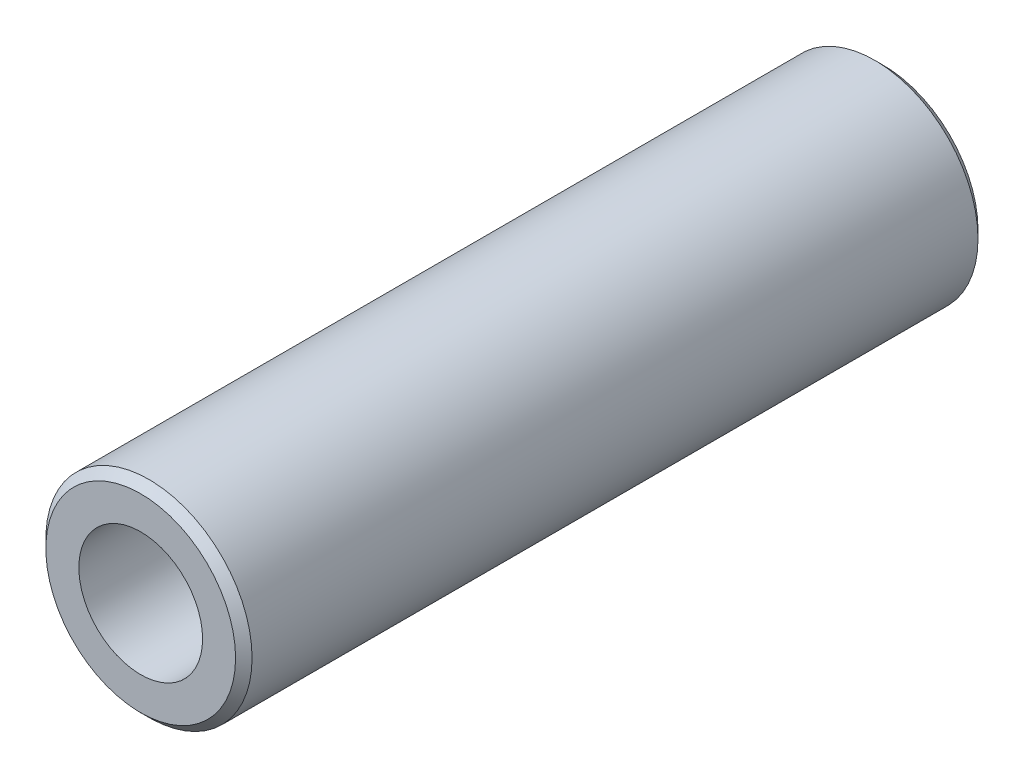
ISO-10303-21;
HEADER;
FILE_DESCRIPTION(('STEP AP214'),'2;1');
FILE_NAME('part.step','',(''),(''),'','','');
FILE_SCHEMA(('AUTOMOTIVE_DESIGN { 1 0 10303 214 1 1 1 1 }'));
ENDSEC;
DATA;
#1=APPLICATION_CONTEXT('core data for automotive mechanical design processes');
#2=APPLICATION_PROTOCOL_DEFINITION('international standard','automotive_design',2000,#1);
#3=PRODUCT_CONTEXT('',#1,'mechanical');
#4=PRODUCT('Part','Part','',(#3));
#5=PRODUCT_RELATED_PRODUCT_CATEGORY('part','',(#4));
#6=PRODUCT_DEFINITION_FORMATION('','',#4);
#7=PRODUCT_DEFINITION_CONTEXT('part definition',#1,'design');
#8=PRODUCT_DEFINITION('design','',#6,#7);
#9=PRODUCT_DEFINITION_SHAPE('','',#8);
#10=(LENGTH_UNIT() NAMED_UNIT(*) SI_UNIT(.MILLI.,.METRE.));
#11=(NAMED_UNIT(*) PLANE_ANGLE_UNIT() SI_UNIT($,.RADIAN.));
#12=(NAMED_UNIT(*) SI_UNIT($,.STERADIAN.) SOLID_ANGLE_UNIT());
#13=UNCERTAINTY_MEASURE_WITH_UNIT(LENGTH_MEASURE(1.E-05),#10,'distance_accuracy_value','');
#14=(GEOMETRIC_REPRESENTATION_CONTEXT(3) GLOBAL_UNCERTAINTY_ASSIGNED_CONTEXT((#13)) GLOBAL_UNIT_ASSIGNED_CONTEXT((#10,
#11,#12)) REPRESENTATION_CONTEXT('',''));
#15=CARTESIAN_POINT('',(0.,0.,0.));
#16=DIRECTION('',(0.,0.,1.));
#17=DIRECTION('',(1.,0.,0.));
#18=AXIS2_PLACEMENT_3D('',#15,#16,#17);
#19=CARTESIAN_POINT('',(0.,0.,22.5));
#20=DIRECTION('',(0.,0.,1.));
#21=DIRECTION('',(1.,0.,0.));
#22=AXIS2_PLACEMENT_3D('',#19,#20,#21);
#23=PLANE('',#22);
#24=CARTESIAN_POINT('',(0.,0.,22.5));
#25=DIRECTION('',(0.,0.,1.));
#26=DIRECTION('',(1.,0.,0.));
#27=AXIS2_PLACEMENT_3D('',#24,#25,#26);
#28=CIRCLE('',#27,5.75000000000002);
#29=CARTESIAN_POINT('',(5.75000000000002,0.,22.5));
#30=VERTEX_POINT('',#29);
#31=EDGE_CURVE('E11',#30,#30,#28,.T.);
#32=ORIENTED_EDGE('',*,*,#31,.T.);
#33=EDGE_LOOP('',(#32));
#34=FACE_BOUND('',#33,.T.);
#35=CARTESIAN_POINT('',(0.,0.,22.5));
#36=DIRECTION('',(0.,0.,1.));
#37=DIRECTION('',(1.,0.,0.));
#38=AXIS2_PLACEMENT_3D('',#35,#36,#37);
#39=CIRCLE('',#38,3.75);
#40=CARTESIAN_POINT('',(3.75,0.,22.5));
#41=VERTEX_POINT('',#40);
#42=EDGE_CURVE('E67',#41,#41,#39,.T.);
#43=ORIENTED_EDGE('',*,*,#42,.F.);
#44=EDGE_LOOP('',(#43));
#45=FACE_BOUND('',#44,.T.);
#46=ADVANCED_FACE('F43',(#34,#45),#23,.T.);
#47=CARTESIAN_POINT('',(0.,0.,-22.5));
#48=DIRECTION('',(0.,0.,1.));
#49=DIRECTION('',(1.,0.,0.));
#50=AXIS2_PLACEMENT_3D('',#47,#48,#49);
#51=PLANE('',#50);
#52=CARTESIAN_POINT('',(0.,0.,-22.5));
#53=DIRECTION('',(0.,0.,1.));
#54=DIRECTION('',(1.,0.,0.));
#55=AXIS2_PLACEMENT_3D('',#52,#53,#54);
#56=CIRCLE('',#55,5.74999999999996);
#57=CARTESIAN_POINT('',(5.74999999999996,0.,-22.5));
#58=VERTEX_POINT('',#57);
#59=EDGE_CURVE('E51',#58,#58,#56,.F.);
#60=ORIENTED_EDGE('',*,*,#59,.T.);
#61=EDGE_LOOP('',(#60));
#62=FACE_BOUND('',#61,.T.);
#63=CARTESIAN_POINT('',(0.,0.,-22.5));
#64=DIRECTION('',(0.,0.,1.));
#65=DIRECTION('',(1.,0.,0.));
#66=AXIS2_PLACEMENT_3D('',#63,#64,#65);
#67=CIRCLE('',#66,3.75);
#68=CARTESIAN_POINT('',(3.75,0.,-22.5));
#69=VERTEX_POINT('',#68);
#70=EDGE_CURVE('E68',#69,#69,#67,.T.);
#71=ORIENTED_EDGE('',*,*,#70,.T.);
#72=EDGE_LOOP('',(#71));
#73=FACE_BOUND('',#72,.T.);
#74=ADVANCED_FACE('F80',(#62,#73),#51,.F.);
#75=CARTESIAN_POINT('',(0.,0.,22.5));
#76=DIRECTION('',(0.,0.,-1.));
#77=DIRECTION('',(-1.,0.,0.));
#78=AXIS2_PLACEMENT_3D('',#75,#76,#77);
#79=CYLINDRICAL_SURFACE('',#78,6.25);
#80=CARTESIAN_POINT('',(0.,0.,-22.));
#81=DIRECTION('',(0.,0.,1.));
#82=DIRECTION('',(1.,0.,0.));
#83=AXIS2_PLACEMENT_3D('',#80,#81,#82);
#84=CIRCLE('',#83,6.25);
#85=CARTESIAN_POINT('',(6.25,0.,-22.));
#86=VERTEX_POINT('',#85);
#87=EDGE_CURVE('E56',#86,#86,#84,.T.);
#88=ORIENTED_EDGE('',*,*,#87,.T.);
#89=EDGE_LOOP('',(#88));
#90=FACE_BOUND('',#89,.T.);
#91=CARTESIAN_POINT('',(0.,0.,22.));
#92=DIRECTION('',(0.,0.,1.));
#93=DIRECTION('',(1.,0.,0.));
#94=AXIS2_PLACEMENT_3D('',#91,#92,#93);
#95=CIRCLE('',#94,6.25);
#96=CARTESIAN_POINT('',(6.25,0.,22.));
#97=VERTEX_POINT('',#96);
#98=EDGE_CURVE('E61',#97,#97,#95,.F.);
#99=ORIENTED_EDGE('',*,*,#98,.T.);
#100=EDGE_LOOP('',(#99));
#101=FACE_BOUND('',#100,.T.);
#102=ADVANCED_FACE('F85',(#90,#101),#79,.T.);
#103=CARTESIAN_POINT('',(0.,0.,22.5));
#104=DIRECTION('',(0.,0.,-1.));
#105=DIRECTION('',(-1.,0.,0.));
#106=AXIS2_PLACEMENT_3D('',#103,#104,#105);
#107=CYLINDRICAL_SURFACE('',#106,3.75);
#108=ORIENTED_EDGE('',*,*,#42,.T.);
#109=EDGE_LOOP('',(#108));
#110=FACE_BOUND('',#109,.T.);
#111=ORIENTED_EDGE('',*,*,#70,.F.);
#112=EDGE_LOOP('',(#111));
#113=FACE_BOUND('',#112,.T.);
#114=ADVANCED_FACE('F76',(#110,#113),#107,.F.);
#115=CARTESIAN_POINT('',(0.,0.,-22.));
#116=DIRECTION('',(0.,0.,1.));
#117=DIRECTION('',(1.,0.,0.));
#118=AXIS2_PLACEMENT_3D('',#115,#116,#117);
#119=CONICAL_SURFACE('',#118,6.25,0.785398163397454);
#120=ORIENTED_EDGE('',*,*,#59,.F.);
#121=EDGE_LOOP('',(#120));
#122=FACE_BOUND('',#121,.T.);
#123=ORIENTED_EDGE('',*,*,#87,.F.);
#124=EDGE_LOOP('',(#123));
#125=FACE_BOUND('',#124,.T.);
#126=ADVANCED_FACE('F91',(#122,#125),#119,.T.);
#127=CARTESIAN_POINT('',(0.,0.,22.5));
#128=DIRECTION('',(0.,0.,-1.));
#129=DIRECTION('',(-1.,0.,0.));
#130=AXIS2_PLACEMENT_3D('',#127,#128,#129);
#131=CONICAL_SURFACE('',#130,5.75000000000002,0.785398163397448);
#132=ORIENTED_EDGE('',*,*,#98,.F.);
#133=EDGE_LOOP('',(#132));
#134=FACE_BOUND('',#133,.T.);
#135=ORIENTED_EDGE('',*,*,#31,.F.);
#136=EDGE_LOOP('',(#135));
#137=FACE_BOUND('',#136,.T.);
#138=ADVANCED_FACE('F45',(#134,#137),#131,.T.);
#139=CLOSED_SHELL('',(#46,#74,#102,#114,#126,#138));
#140=MANIFOLD_SOLID_BREP('B2',#139);
#141=ADVANCED_BREP_SHAPE_REPRESENTATION('',(#18,#140),#14);
#142=SHAPE_DEFINITION_REPRESENTATION(#9,#141);
ENDSEC;
END-ISO-10303-21;
